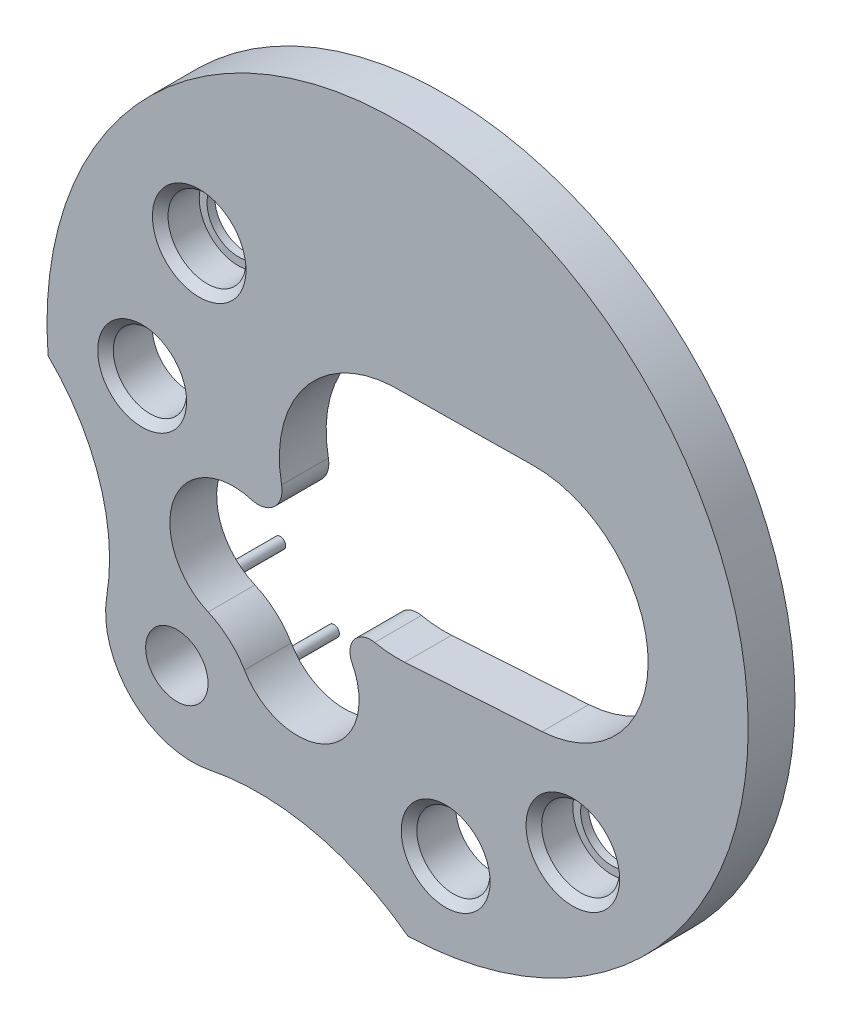
ISO-10303-21;
HEADER;
FILE_DESCRIPTION(('STEP AP214'),'2;1');
FILE_NAME('part.step','',(''),(''),'','','');
FILE_SCHEMA(('AUTOMOTIVE_DESIGN { 1 0 10303 214 1 1 1 1 }'));
ENDSEC;
DATA;
#1=APPLICATION_CONTEXT('core data for automotive mechanical design processes');
#2=APPLICATION_PROTOCOL_DEFINITION('international standard','automotive_design',2000,#1);
#3=PRODUCT_CONTEXT('',#1,'mechanical');
#4=PRODUCT('Part','Part','',(#3));
#5=PRODUCT_RELATED_PRODUCT_CATEGORY('part','',(#4));
#6=PRODUCT_DEFINITION_FORMATION('','',#4);
#7=PRODUCT_DEFINITION_CONTEXT('part definition',#1,'design');
#8=PRODUCT_DEFINITION('design','',#6,#7);
#9=PRODUCT_DEFINITION_SHAPE('','',#8);
#10=(LENGTH_UNIT() NAMED_UNIT(*) SI_UNIT(.MILLI.,.METRE.));
#11=(NAMED_UNIT(*) PLANE_ANGLE_UNIT() SI_UNIT($,.RADIAN.));
#12=(NAMED_UNIT(*) SI_UNIT($,.STERADIAN.) SOLID_ANGLE_UNIT());
#13=UNCERTAINTY_MEASURE_WITH_UNIT(LENGTH_MEASURE(1.E-05),#10,'distance_accuracy_value','');
#14=(GEOMETRIC_REPRESENTATION_CONTEXT(3) GLOBAL_UNCERTAINTY_ASSIGNED_CONTEXT((#13)) GLOBAL_UNIT_ASSIGNED_CONTEXT((#10,
#11,#12)) REPRESENTATION_CONTEXT('',''));
#15=CARTESIAN_POINT('',(0.,0.,0.));
#16=DIRECTION('',(0.,0.,1.));
#17=DIRECTION('',(1.,0.,0.));
#18=AXIS2_PLACEMENT_3D('',#15,#16,#17);
#19=CARTESIAN_POINT('',(38.1336619041062,-13.7694391477594,7.85978802184939));
#20=DIRECTION('',(0.,0.,-1.));
#21=DIRECTION('',(-1.,0.,0.));
#22=AXIS2_PLACEMENT_3D('',#19,#20,#21);
#23=CYLINDRICAL_SURFACE('',#22,0.61);
#24=CARTESIAN_POINT('',(38.1336619041062,-13.7694391477594,7.73778802184196));
#25=DIRECTION('',(0.,0.,1.));
#26=DIRECTION('',(1.,0.,0.));
#27=AXIS2_PLACEMENT_3D('',#24,#25,#26);
#28=CIRCLE('',#27,0.609999999987422);
#29=CARTESIAN_POINT('',(38.7436619040936,-13.7694391477594,7.73778802184196));
#30=VERTEX_POINT('',#29);
#31=EDGE_CURVE('E125',#30,#30,#28,.T.);
#32=ORIENTED_EDGE('',*,*,#31,.T.);
#33=EDGE_LOOP('',(#32));
#34=FACE_BOUND('',#33,.T.);
#35=CARTESIAN_POINT('',(38.1336619041062,-13.7694391477594,7.24978802184939));
#36=DIRECTION('',(0.,0.,-1.));
#37=DIRECTION('',(-1.,0.,0.));
#38=AXIS2_PLACEMENT_3D('',#35,#36,#37);
#39=CIRCLE('',#38,0.61);
#40=CARTESIAN_POINT('',(37.5236619041062,-13.7694391477594,7.24978802184939));
#41=VERTEX_POINT('',#40);
#42=EDGE_CURVE('E39',#41,#41,#39,.F.);
#43=ORIENTED_EDGE('',*,*,#42,.F.);
#44=EDGE_LOOP('',(#43));
#45=FACE_BOUND('',#44,.T.);
#46=ADVANCED_FACE('F36',(#34,#45),#23,.F.);
#47=CARTESIAN_POINT('',(43.9795275046916,-19.0988890111935,7.85978802184939));
#48=DIRECTION('',(0.,0.,-1.));
#49=DIRECTION('',(-1.,0.,0.));
#50=AXIS2_PLACEMENT_3D('',#47,#48,#49);
#51=CYLINDRICAL_SURFACE('',#50,0.61);
#52=CARTESIAN_POINT('',(43.9795275046916,-19.0988890111935,7.73778802185583));
#53=DIRECTION('',(0.,0.,1.));
#54=DIRECTION('',(1.,0.,0.));
#55=AXIS2_PLACEMENT_3D('',#52,#53,#54);
#56=CIRCLE('',#55,0.609999999991318);
#57=CARTESIAN_POINT('',(44.589527504683,-19.0988890111935,7.73778802185583));
#58=VERTEX_POINT('',#57);
#59=EDGE_CURVE('E122',#58,#58,#56,.T.);
#60=ORIENTED_EDGE('',*,*,#59,.T.);
#61=EDGE_LOOP('',(#60));
#62=FACE_BOUND('',#61,.T.);
#63=CARTESIAN_POINT('',(43.9795275046916,-19.0988890111935,7.24978802184939));
#64=DIRECTION('',(0.,0.,-1.));
#65=DIRECTION('',(-1.,0.,0.));
#66=AXIS2_PLACEMENT_3D('',#63,#64,#65);
#67=CIRCLE('',#66,0.61);
#68=CARTESIAN_POINT('',(43.3695275046916,-19.0988890111935,7.24978802184939));
#69=VERTEX_POINT('',#68);
#70=EDGE_CURVE('E236',#69,#69,#67,.F.);
#71=ORIENTED_EDGE('',*,*,#70,.F.);
#72=EDGE_LOOP('',(#71));
#73=FACE_BOUND('',#72,.T.);
#74=ADVANCED_FACE('F246',(#62,#73),#51,.F.);
#75=CARTESIAN_POINT('',(38.1336619041062,-13.7694391477594,7.85978802185294));
#76=DIRECTION('',(0.,0.,1.));
#77=DIRECTION('',(1.,0.,0.));
#78=AXIS2_PLACEMENT_3D('',#75,#76,#77);
#79=CONICAL_SURFACE('',#78,0.731999999984537,0.785398163340605);
#80=CARTESIAN_POINT('',(38.1336619041062,-13.7694391477594,7.85978802185294));
#81=DIRECTION('',(0.,0.,1.));
#82=DIRECTION('',(1.,0.,0.));
#83=AXIS2_PLACEMENT_3D('',#80,#81,#82);
#84=CIRCLE('',#83,0.731999999984537);
#85=CARTESIAN_POINT('',(38.8656619040907,-13.7694391477594,7.85978802185294));
#86=VERTEX_POINT('',#85);
#87=EDGE_CURVE('E234',#86,#86,#84,.F.);
#88=ORIENTED_EDGE('',*,*,#87,.F.);
#89=EDGE_LOOP('',(#88));
#90=FACE_BOUND('',#89,.T.);
#91=ORIENTED_EDGE('',*,*,#31,.F.);
#92=EDGE_LOOP('',(#91));
#93=FACE_BOUND('',#92,.T.);
#94=ADVANCED_FACE('F251',(#90,#93),#79,.F.);
#95=CARTESIAN_POINT('',(43.9795275046916,-19.0988890111935,7.85978802183907));
#96=DIRECTION('',(0.,0.,1.));
#97=DIRECTION('',(1.,0.,0.));
#98=AXIS2_PLACEMENT_3D('',#95,#96,#97);
#99=CONICAL_SURFACE('',#98,0.731999999974564,0.785398163340605);
#100=CARTESIAN_POINT('',(43.9795275046916,-19.0988890111935,7.85978802185294));
#101=DIRECTION('',(0.,0.,1.));
#102=DIRECTION('',(1.,0.,0.));
#103=AXIS2_PLACEMENT_3D('',#100,#101,#102);
#104=CIRCLE('',#103,0.731999999988434);
#105=CARTESIAN_POINT('',(44.7115275046801,-19.0988890111935,7.85978802185294));
#106=VERTEX_POINT('',#105);
#107=EDGE_CURVE('E231',#106,#106,#104,.F.);
#108=ORIENTED_EDGE('',*,*,#107,.F.);
#109=EDGE_LOOP('',(#108));
#110=FACE_BOUND('',#109,.T.);
#111=ORIENTED_EDGE('',*,*,#59,.F.);
#112=EDGE_LOOP('',(#111));
#113=FACE_BOUND('',#112,.T.);
#114=ADVANCED_FACE('F367',(#110,#113),#99,.F.);
#115=CARTESIAN_POINT('',(38.1336619041062,-13.7694391477594,7.24978802184939));
#116=DIRECTION('',(0.,0.,1.));
#117=DIRECTION('',(1.,0.,0.));
#118=AXIS2_PLACEMENT_3D('',#115,#116,#117);
#119=PLANE('',#118);
#120=CARTESIAN_POINT('',(38.1336619041062,-13.7694391477594,7.24978802184939));
#121=DIRECTION('',(0.,0.,1.));
#122=DIRECTION('',(1.,0.,0.));
#123=AXIS2_PLACEMENT_3D('',#120,#121,#122);
#124=CIRCLE('',#123,0.488);
#125=CARTESIAN_POINT('',(38.6216619041062,-13.7694391477594,7.24978802184939));
#126=VERTEX_POINT('',#125);
#127=EDGE_CURVE('E191',#126,#126,#124,.F.);
#128=ORIENTED_EDGE('',*,*,#127,.T.);
#129=EDGE_LOOP('',(#128));
#130=FACE_BOUND('',#129,.T.);
#131=ORIENTED_EDGE('',*,*,#42,.T.);
#132=EDGE_LOOP('',(#131));
#133=FACE_BOUND('',#132,.T.);
#134=ADVANCED_FACE('F243',(#130,#133),#119,.T.);
#135=CARTESIAN_POINT('',(37.2405623710244,-16.0148110692987,7.8597880218252));
#136=DIRECTION('',(0.,0.,1.));
#137=DIRECTION('',(1.,0.,0.));
#138=AXIS2_PLACEMENT_3D('',#135,#136,#137);
#139=CONICAL_SURFACE('',#138,0.695399999973681,0.785398163454292);
#140=CARTESIAN_POINT('',(37.2405623710244,-16.0148110692987,7.73778802184939));
#141=DIRECTION('',(0.,0.,1.));
#142=DIRECTION('',(1.,0.,0.));
#143=AXIS2_PLACEMENT_3D('',#140,#141,#142);
#144=CIRCLE('',#143,0.5734);
#145=CARTESIAN_POINT('',(37.8139623710244,-16.0148110692987,7.73778802184939));
#146=VERTEX_POINT('',#145);
#147=EDGE_CURVE('E190',#146,#146,#144,.F.);
#148=ORIENTED_EDGE('',*,*,#147,.T.);
#149=EDGE_LOOP('',(#148));
#150=FACE_BOUND('',#149,.T.);
#151=CARTESIAN_POINT('',(37.2405623710244,-16.0148110692987,7.8597880218434));
#152=DIRECTION('',(0.,0.,1.));
#153=DIRECTION('',(1.,0.,0.));
#154=AXIS2_PLACEMENT_3D('',#151,#152,#153);
#155=CIRCLE('',#154,0.695399999991878);
#156=CARTESIAN_POINT('',(37.9359623710163,-16.0148110692987,7.8597880218434));
#157=VERTEX_POINT('',#156);
#158=EDGE_CURVE('E99',#157,#157,#155,.F.);
#159=ORIENTED_EDGE('',*,*,#158,.F.);
#160=EDGE_LOOP('',(#159));
#161=FACE_BOUND('',#160,.T.);
#162=ADVANCED_FACE('F360',(#150,#161),#139,.F.);
#163=CARTESIAN_POINT('',(43.9795275046916,-19.0988890111935,7.24978802184939));
#164=DIRECTION('',(0.,0.,1.));
#165=DIRECTION('',(1.,0.,0.));
#166=AXIS2_PLACEMENT_3D('',#163,#164,#165);
#167=PLANE('',#166);
#168=CARTESIAN_POINT('',(43.9795275046916,-19.0988890111935,7.24978802184939));
#169=DIRECTION('',(0.,0.,1.));
#170=DIRECTION('',(1.,0.,0.));
#171=AXIS2_PLACEMENT_3D('',#168,#169,#170);
#172=CIRCLE('',#171,0.488);
#173=CARTESIAN_POINT('',(44.4675275046916,-19.0988890111935,7.24978802184939));
#174=VERTEX_POINT('',#173);
#175=EDGE_CURVE('E187',#174,#174,#172,.F.);
#176=ORIENTED_EDGE('',*,*,#175,.T.);
#177=EDGE_LOOP('',(#176));
#178=FACE_BOUND('',#177,.T.);
#179=ORIENTED_EDGE('',*,*,#70,.T.);
#180=EDGE_LOOP('',(#179));
#181=FACE_BOUND('',#180,.T.);
#182=ADVANCED_FACE('F356',(#178,#181),#167,.T.);
#183=CARTESIAN_POINT('',(41.9893103568643,-20.1477658422483,7.85978802185294));
#184=DIRECTION('',(0.,0.,1.));
#185=DIRECTION('',(1.,0.,0.));
#186=AXIS2_PLACEMENT_3D('',#183,#184,#185);
#187=CONICAL_SURFACE('',#186,0.695400000002009,0.785398163397448);
#188=CARTESIAN_POINT('',(41.9893103568643,-20.1477658422483,7.73778802184939));
#189=DIRECTION('',(0.,0.,1.));
#190=DIRECTION('',(1.,0.,0.));
#191=AXIS2_PLACEMENT_3D('',#188,#189,#190);
#192=CIRCLE('',#191,0.5734);
#193=CARTESIAN_POINT('',(42.5627103568643,-20.1477658422483,7.73778802184939));
#194=VERTEX_POINT('',#193);
#195=EDGE_CURVE('E186',#194,#194,#192,.F.);
#196=ORIENTED_EDGE('',*,*,#195,.T.);
#197=EDGE_LOOP('',(#196));
#198=FACE_BOUND('',#197,.T.);
#199=CARTESIAN_POINT('',(41.9893103568643,-20.1477658422483,7.85978802185294));
#200=DIRECTION('',(0.,0.,1.));
#201=DIRECTION('',(1.,0.,0.));
#202=AXIS2_PLACEMENT_3D('',#199,#200,#201);
#203=CIRCLE('',#202,0.695400000002009);
#204=CARTESIAN_POINT('',(42.6847103568663,-20.1477658422483,7.85978802185294));
#205=VERTEX_POINT('',#204);
#206=EDGE_CURVE('E228',#205,#205,#203,.F.);
#207=ORIENTED_EDGE('',*,*,#206,.F.);
#208=EDGE_LOOP('',(#207));
#209=FACE_BOUND('',#208,.T.);
#210=ADVANCED_FACE('F352',(#198,#209),#187,.F.);
#211=CARTESIAN_POINT('',(41.0582115328778,-16.1168968136741,7.85978802184939));
#212=DIRECTION('',(0.,0.,1.));
#213=DIRECTION('',(1.,0.,0.));
#214=AXIS2_PLACEMENT_3D('',#211,#212,#213);
#215=PLANE('',#214);
#216=ORIENTED_EDGE('',*,*,#158,.T.);
#217=EDGE_LOOP('',(#216));
#218=FACE_BOUND('',#217,.T.);
#219=ORIENTED_EDGE('',*,*,#206,.T.);
#220=EDGE_LOOP('',(#219));
#221=FACE_BOUND('',#220,.T.);
#222=CARTESIAN_POINT('',(37.7835013486702,-19.6676256288766,7.85978802184939));
#223=DIRECTION('',(0.,0.,1.));
#224=DIRECTION('',(1.,0.,0.));
#225=AXIS2_PLACEMENT_3D('',#222,#223,#224);
#226=CIRCLE('',#225,0.488);
#227=CARTESIAN_POINT('',(38.2715013486702,-19.6676256288766,7.85978802184939));
#228=VERTEX_POINT('',#227);
#229=EDGE_CURVE('E183',#228,#228,#226,.F.);
#230=ORIENTED_EDGE('',*,*,#229,.T.);
#231=EDGE_LOOP('',(#230));
#232=FACE_BOUND('',#231,.T.);
#233=CARTESIAN_POINT('',(38.6659590422914,-17.7867727829153,7.85978802184939));
#234=DIRECTION('',(0.,0.,1.));
#235=DIRECTION('',(1.,0.,0.));
#236=AXIS2_PLACEMENT_3D('',#233,#234,#235);
#237=CIRCLE('',#236,0.991674632911348);
#238=CARTESIAN_POINT('',(38.2730184708911,-18.6972760969714,7.85978802184939));
#239=VERTEX_POINT('',#238);
#240=CARTESIAN_POINT('',(38.9459024987134,-16.83543149885,7.85978802184939));
#241=VERTEX_POINT('',#240);
#242=EDGE_CURVE('E198',#239,#241,#237,.F.);
#243=ORIENTED_EDGE('',*,*,#242,.T.);
#244=CARTESIAN_POINT('',(39.052299831871,-16.4738578552267,7.85978802184939));
#245=DIRECTION('',(0.,0.,1.));
#246=DIRECTION('',(1.,0.,0.));
#247=AXIS2_PLACEMENT_3D('',#244,#245,#246);
#248=CIRCLE('',#247,0.376903027668744);
#249=CARTESIAN_POINT('',(39.4221081989458,-16.4010728024538,7.85978802184939));
#250=VERTEX_POINT('',#249);
#251=EDGE_CURVE('E194',#250,#241,#248,.F.);
#252=ORIENTED_EDGE('',*,*,#251,.F.);
#253=CARTESIAN_POINT('',(41.2374827506637,-16.0437738760014,7.85978802184939));
#254=DIRECTION('',(0.,0.,1.));
#255=DIRECTION('',(1.,0.,0.));
#256=AXIS2_PLACEMENT_3D('',#253,#254,#255);
#257=CIRCLE('',#256,1.85020195813052);
#258=CARTESIAN_POINT('',(41.1506610272166,-14.19561011859,7.85978802184939));
#259=VERTEX_POINT('',#258);
#260=EDGE_CURVE('E88',#250,#259,#257,.F.);
#261=ORIENTED_EDGE('',*,*,#260,.T.);
#262=DIRECTION('',(0.999922672411607,0.0124358030391901,0.));
#263=VECTOR('',#262,1.);
#264=CARTESIAN_POINT('',(42.2578860435572,-14.1818398215429,7.85978802184939));
#265=LINE('',#264,#263);
#266=CARTESIAN_POINT('',(43.3651110599051,-14.1680695244953,7.85978802184939));
#267=VERTEX_POINT('',#266);
#268=EDGE_CURVE('E117',#267,#259,#265,.F.);
#269=ORIENTED_EDGE('',*,*,#268,.F.);
#270=CARTESIAN_POINT('',(43.3871299694428,-15.9385387735962,7.85978802184939));
#271=DIRECTION('',(0.,0.,1.));
#272=DIRECTION('',(1.,0.,0.));
#273=AXIS2_PLACEMENT_3D('',#270,#271,#272);
#274=CIRCLE('',#273,1.77060616580602);
#275=CARTESIAN_POINT('',(43.4975725541586,-17.7056971224357,7.85978802184939));
#276=VERTEX_POINT('',#275);
#277=EDGE_CURVE('E120',#267,#276,#274,.F.);
#278=ORIENTED_EDGE('',*,*,#277,.T.);
#279=DIRECTION('',(-0.998052747678446,-0.0623755789672829,0.));
#280=VECTOR('',#279,1.);
#281=CARTESIAN_POINT('',(42.423655115559,-17.7728140380011,7.85978802184939));
#282=LINE('',#281,#280);
#283=CARTESIAN_POINT('',(41.3497376769588,-17.8399309535669,7.85978802184939));
#284=VERTEX_POINT('',#283);
#285=EDGE_CURVE('E112',#284,#276,#282,.F.);
#286=ORIENTED_EDGE('',*,*,#285,.F.);
#287=CARTESIAN_POINT('',(41.2374827506637,-16.0437738760014,7.85978802184939));
#288=DIRECTION('',(0.,0.,1.));
#289=DIRECTION('',(1.,0.,0.));
#290=AXIS2_PLACEMENT_3D('',#287,#288,#289);
#291=CIRCLE('',#290,1.79966147254636);
#292=CARTESIAN_POINT('',(40.8787065760678,-17.8073104002343,7.85978802184939));
#293=VERTEX_POINT('',#292);
#294=EDGE_CURVE('E115',#284,#293,#291,.F.);
#295=ORIENTED_EDGE('',*,*,#294,.T.);
#296=CARTESIAN_POINT('',(40.8144764628586,-18.1230285516044,7.85978802184939));
#297=DIRECTION('',(0.,0.,1.));
#298=DIRECTION('',(1.,0.,0.));
#299=AXIS2_PLACEMENT_3D('',#296,#297,#298);
#300=CIRCLE('',#299,0.322185441240608);
#301=CARTESIAN_POINT('',(40.5280472286448,-18.2705472024132,7.85978802184939));
#302=VERTEX_POINT('',#301);
#303=EDGE_CURVE('E211',#302,#293,#300,.F.);
#304=ORIENTED_EDGE('',*,*,#303,.F.);
#305=CARTESIAN_POINT('',(39.671847283105,-18.7115128780541,7.85978802184939));
#306=DIRECTION('',(0.,0.,1.));
#307=DIRECTION('',(1.,0.,0.));
#308=AXIS2_PLACEMENT_3D('',#305,#306,#307);
#309=CIRCLE('',#308,0.963083108478048);
#310=CARTESIAN_POINT('',(38.8414829225075,-19.1993900167734,7.85978802184939));
#311=VERTEX_POINT('',#310);
#312=EDGE_CURVE('E207',#302,#311,#309,.F.);
#313=ORIENTED_EDGE('',*,*,#312,.T.);
#314=CARTESIAN_POINT('',(37.7896063907618,-19.8174157136195,7.85978802184939));
#315=DIRECTION('',(0.,0.,1.));
#316=DIRECTION('',(1.,0.,0.));
#317=AXIS2_PLACEMENT_3D('',#314,#315,#316);
#318=CIRCLE('',#317,1.22);
#319=EDGE_CURVE('E203',#239,#311,#318,.F.);
#320=ORIENTED_EDGE('',*,*,#319,.F.);
#321=EDGE_LOOP('',(#243,#252,#261,#269,#278,#286,#295,#304,#313,#320));
#322=FACE_BOUND('',#321,.T.);
#323=ORIENTED_EDGE('',*,*,#107,.T.);
#324=EDGE_LOOP('',(#323));
#325=FACE_BOUND('',#324,.T.);
#326=ORIENTED_EDGE('',*,*,#87,.T.);
#327=EDGE_LOOP('',(#326));
#328=FACE_BOUND('',#327,.T.);
#329=CARTESIAN_POINT('',(39.06505027507,-24.64660251159,7.85978802184939));
#330=DIRECTION('',(0.,0.,1.));
#331=DIRECTION('',(1.,0.,0.));
#332=AXIS2_PLACEMENT_3D('',#329,#330,#331);
#333=CIRCLE('',#332,3.89663081484112);
#334=CARTESIAN_POINT('',(38.2918493374231,-20.8274544367975,7.85978802184939));
#335=VERTEX_POINT('',#334);
#336=CARTESIAN_POINT('',(41.4005130726079,-21.527412676316,7.85978802184939));
#337=VERTEX_POINT('',#336);
#338=EDGE_CURVE('E83',#335,#337,#333,.F.);
#339=ORIENTED_EDGE('',*,*,#338,.T.);
#340=CARTESIAN_POINT('',(41.2374827506637,-16.0437738760014,7.85978802184939));
#341=DIRECTION('',(0.,0.,1.));
#342=DIRECTION('',(1.,0.,0.));
#343=AXIS2_PLACEMENT_3D('',#340,#341,#342);
#344=CIRCLE('',#343,5.48606173663672);
#345=CARTESIAN_POINT('',(35.7685979765421,-16.4775626559047,7.85978802184939));
#346=VERTEX_POINT('',#345);
#347=EDGE_CURVE('E77',#346,#337,#344,.F.);
#348=ORIENTED_EDGE('',*,*,#347,.F.);
#349=CARTESIAN_POINT('',(33.5630026451588,-18.7517119612679,7.85978802184939));
#350=DIRECTION('',(0.,0.,1.));
#351=DIRECTION('',(1.,0.,0.));
#352=AXIS2_PLACEMENT_3D('',#349,#350,#351);
#353=CIRCLE('',#352,3.1680286976142);
#354=CARTESIAN_POINT('',(36.6873657132964,-19.2758886942166,7.85978802184939));
#355=VERTEX_POINT('',#354);
#356=EDGE_CURVE('E81',#346,#355,#353,.F.);
#357=ORIENTED_EDGE('',*,*,#356,.T.);
#358=CARTESIAN_POINT('',(38.0230982512306,-19.4999855429369,7.85978802184939));
#359=DIRECTION('',(0.,0.,1.));
#360=DIRECTION('',(1.,0.,0.));
#361=AXIS2_PLACEMENT_3D('',#358,#359,#360);
#362=CIRCLE('',#361,1.35440053547773);
#363=EDGE_CURVE('E223',#335,#355,#362,.F.);
#364=ORIENTED_EDGE('',*,*,#363,.F.);
#365=EDGE_LOOP('',(#339,#348,#357,#364));
#366=FACE_BOUND('',#365,.T.);
#367=ADVANCED_FACE('F79',(#218,#221,#232,#322,#325,#328,#366),#215,.T.);
#368=CARTESIAN_POINT('',(42.2578860435572,-14.1818398215429,6.39578802184939));
#369=DIRECTION('',(0.,0.,-1.));
#370=DIRECTION('',(-1.,0.,0.));
#371=AXIS2_PLACEMENT_3D('',#368,#369,#370);
#372=PLANE('',#371);
#373=CARTESIAN_POINT('',(38.7769454737327,-19.4314145580513,6.39578802184939));
#374=DIRECTION('',(0.,0.,-1.));
#375=DIRECTION('',(-1.,0.,0.));
#376=AXIS2_PLACEMENT_3D('',#373,#374,#375);
#377=CIRCLE('',#376,0.0854);
#378=CARTESIAN_POINT('',(38.6915454737327,-19.4314145580513,6.39578802184939));
#379=VERTEX_POINT('',#378);
#380=EDGE_CURVE('E180',#379,#379,#377,.F.);
#381=ORIENTED_EDGE('',*,*,#380,.F.);
#382=EDGE_LOOP('',(#381));
#383=FACE_BOUND('',#382,.T.);
#384=ADVANCED_FACE('F345',(#383),#372,.T.);
#385=CARTESIAN_POINT('',(42.2578860435572,-14.1818398215429,6.39578802184939));
#386=DIRECTION('',(0.,0.,-1.));
#387=DIRECTION('',(-1.,0.,0.));
#388=AXIS2_PLACEMENT_3D('',#385,#386,#387);
#389=PLANE('',#388);
#390=CARTESIAN_POINT('',(37.936640976968,-18.6580340511375,6.39578802184939));
#391=DIRECTION('',(0.,0.,-1.));
#392=DIRECTION('',(-1.,0.,0.));
#393=AXIS2_PLACEMENT_3D('',#390,#391,#392);
#394=CIRCLE('',#393,0.0854);
#395=CARTESIAN_POINT('',(37.851240976968,-18.6580340511375,6.39578802184939));
#396=VERTEX_POINT('',#395);
#397=EDGE_CURVE('E177',#396,#396,#394,.F.);
#398=ORIENTED_EDGE('',*,*,#397,.F.);
#399=EDGE_LOOP('',(#398));
#400=FACE_BOUND('',#399,.T.);
#401=ADVANCED_FACE('F342',(#400),#389,.T.);
#402=CARTESIAN_POINT('',(33.5630026451588,-18.7517119612679,7.12778802184939));
#403=DIRECTION('',(0.,0.,1.));
#404=DIRECTION('',(1.,0.,0.));
#405=AXIS2_PLACEMENT_3D('',#402,#403,#404);
#406=CYLINDRICAL_SURFACE('',#405,3.1680286976142);
#407=CARTESIAN_POINT('',(33.5630026451588,-18.7517119612679,7.12778802184939));
#408=DIRECTION('',(0.,0.,1.));
#409=DIRECTION('',(1.,0.,0.));
#410=AXIS2_PLACEMENT_3D('',#407,#408,#409);
#411=CIRCLE('',#410,3.1680286976142);
#412=CARTESIAN_POINT('',(35.7685979765421,-16.4775626559047,7.12778802184939));
#413=VERTEX_POINT('',#412);
#414=CARTESIAN_POINT('',(36.6873657132964,-19.2758886942166,7.12778802184939));
#415=VERTEX_POINT('',#414);
#416=EDGE_CURVE('E174',#413,#415,#411,.F.);
#417=ORIENTED_EDGE('',*,*,#416,.T.);
#418=DIRECTION('',(0.,0.,1.));
#419=VECTOR('',#418,1.);
#420=CARTESIAN_POINT('',(36.6873657132964,-19.2758886942167,7.12778802184939));
#421=LINE('',#420,#419);
#422=EDGE_CURVE('E98',#355,#415,#421,.F.);
#423=ORIENTED_EDGE('',*,*,#422,.F.);
#424=ORIENTED_EDGE('',*,*,#356,.F.);
#425=DIRECTION('',(0.,0.,1.));
#426=VECTOR('',#425,1.);
#427=CARTESIAN_POINT('',(35.7685979765421,-16.4775626559055,7.12778802184939));
#428=LINE('',#427,#426);
#429=EDGE_CURVE('E89',#413,#346,#428,.T.);
#430=ORIENTED_EDGE('',*,*,#429,.F.);
#431=EDGE_LOOP('',(#417,#423,#424,#430));
#432=FACE_BOUND('',#431,.T.);
#433=ADVANCED_FACE('F94',(#432),#406,.F.);
#434=CARTESIAN_POINT('',(38.0230982512306,-19.4999855429369,7.12778802184939));
#435=DIRECTION('',(0.,0.,1.));
#436=DIRECTION('',(1.,0.,0.));
#437=AXIS2_PLACEMENT_3D('',#434,#435,#436);
#438=CYLINDRICAL_SURFACE('',#437,1.35440053547773);
#439=DIRECTION('',(0.,0.,1.));
#440=VECTOR('',#439,1.);
#441=CARTESIAN_POINT('',(38.2918493374232,-20.8274544367975,7.12778802184939));
#442=LINE('',#441,#440);
#443=CARTESIAN_POINT('',(38.2918493374231,-20.8274544367975,7.12778802184939));
#444=VERTEX_POINT('',#443);
#445=EDGE_CURVE('E107',#444,#335,#442,.T.);
#446=ORIENTED_EDGE('',*,*,#445,.T.);
#447=ORIENTED_EDGE('',*,*,#363,.T.);
#448=ORIENTED_EDGE('',*,*,#422,.T.);
#449=CARTESIAN_POINT('',(38.0230982512306,-19.4999855429369,7.12778802184939));
#450=DIRECTION('',(0.,0.,1.));
#451=DIRECTION('',(1.,0.,0.));
#452=AXIS2_PLACEMENT_3D('',#449,#450,#451);
#453=CIRCLE('',#452,1.35440053547773);
#454=EDGE_CURVE('E171',#415,#444,#453,.T.);
#455=ORIENTED_EDGE('',*,*,#454,.T.);
#456=EDGE_LOOP('',(#446,#447,#448,#455));
#457=FACE_BOUND('',#456,.T.);
#458=ADVANCED_FACE('F335',(#457),#438,.T.);
#459=CARTESIAN_POINT('',(39.06505027507,-24.64660251159,7.12778802184939));
#460=DIRECTION('',(0.,0.,1.));
#461=DIRECTION('',(1.,0.,0.));
#462=AXIS2_PLACEMENT_3D('',#459,#460,#461);
#463=CYLINDRICAL_SURFACE('',#462,3.89663081484112);
#464=CARTESIAN_POINT('',(39.06505027507,-24.64660251159,7.12778802184939));
#465=DIRECTION('',(0.,0.,1.));
#466=DIRECTION('',(1.,0.,0.));
#467=AXIS2_PLACEMENT_3D('',#464,#465,#466);
#468=CIRCLE('',#467,3.89663081484112);
#469=CARTESIAN_POINT('',(41.4005130726079,-21.527412676316,7.12778802184939));
#470=VERTEX_POINT('',#469);
#471=EDGE_CURVE('E168',#444,#470,#468,.F.);
#472=ORIENTED_EDGE('',*,*,#471,.T.);
#473=DIRECTION('',(0.,0.,1.));
#474=VECTOR('',#473,1.);
#475=CARTESIAN_POINT('',(41.4005130726059,-21.5274126763161,7.12778802184939));
#476=LINE('',#475,#474);
#477=EDGE_CURVE('E105',#337,#470,#476,.F.);
#478=ORIENTED_EDGE('',*,*,#477,.F.);
#479=ORIENTED_EDGE('',*,*,#338,.F.);
#480=ORIENTED_EDGE('',*,*,#445,.F.);
#481=EDGE_LOOP('',(#472,#478,#479,#480));
#482=FACE_BOUND('',#481,.T.);
#483=ADVANCED_FACE('F332',(#482),#463,.F.);
#484=CARTESIAN_POINT('',(41.2374827506637,-16.0437738760014,7.12778802184939));
#485=DIRECTION('',(0.,0.,1.));
#486=DIRECTION('',(1.,0.,0.));
#487=AXIS2_PLACEMENT_3D('',#484,#485,#486);
#488=CYLINDRICAL_SURFACE('',#487,5.48606173663672);
#489=ORIENTED_EDGE('',*,*,#429,.T.);
#490=ORIENTED_EDGE('',*,*,#347,.T.);
#491=ORIENTED_EDGE('',*,*,#477,.T.);
#492=CARTESIAN_POINT('',(41.2374827506637,-16.0437738760014,7.12778802184939));
#493=DIRECTION('',(0.,0.,1.));
#494=DIRECTION('',(1.,0.,0.));
#495=AXIS2_PLACEMENT_3D('',#492,#493,#494);
#496=CIRCLE('',#495,5.48606173663672);
#497=EDGE_CURVE('E104',#470,#413,#496,.T.);
#498=ORIENTED_EDGE('',*,*,#497,.T.);
#499=EDGE_LOOP('',(#489,#490,#491,#498));
#500=FACE_BOUND('',#499,.T.);
#501=ADVANCED_FACE('F102',(#500),#488,.T.);
#502=CARTESIAN_POINT('',(41.2374827506637,-16.0437738760014,7.12778802184939));
#503=DIRECTION('',(0.,0.,1.));
#504=DIRECTION('',(1.,0.,0.));
#505=AXIS2_PLACEMENT_3D('',#502,#503,#504);
#506=CYLINDRICAL_SURFACE('',#505,1.85020195813052);
#507=DIRECTION('',(0.,0.,1.));
#508=VECTOR('',#507,1.);
#509=CARTESIAN_POINT('',(39.4221081989461,-16.4010728024537,7.12778802184939));
#510=LINE('',#509,#508);
#511=CARTESIAN_POINT('',(39.4221081989458,-16.4010728024538,7.12778802184939));
#512=VERTEX_POINT('',#511);
#513=EDGE_CURVE('E197',#512,#250,#510,.T.);
#514=ORIENTED_EDGE('',*,*,#513,.F.);
#515=CARTESIAN_POINT('',(41.2374827506637,-16.0437738760014,7.12778802184939));
#516=DIRECTION('',(0.,0.,1.));
#517=DIRECTION('',(1.,0.,0.));
#518=AXIS2_PLACEMENT_3D('',#515,#516,#517);
#519=CIRCLE('',#518,1.85020195813052);
#520=CARTESIAN_POINT('',(41.1506610272177,-14.1956101185899,7.12778802184939));
#521=VERTEX_POINT('',#520);
#522=EDGE_CURVE('E54',#512,#521,#519,.F.);
#523=ORIENTED_EDGE('',*,*,#522,.T.);
#524=DIRECTION('',(0.,0.,1.));
#525=VECTOR('',#524,1.);
#526=CARTESIAN_POINT('',(41.1506610272066,-14.1956101185901,7.12778802184939));
#527=LINE('',#526,#525);
#528=EDGE_CURVE('E121',#259,#521,#527,.F.);
#529=ORIENTED_EDGE('',*,*,#528,.F.);
#530=ORIENTED_EDGE('',*,*,#260,.F.);
#531=EDGE_LOOP('',(#514,#523,#529,#530));
#532=FACE_BOUND('',#531,.T.);
#533=ADVANCED_FACE('F325',(#532),#506,.F.);
#534=CARTESIAN_POINT('',(42.2578860435572,-14.1818398215429,7.12778802184939));
#535=DIRECTION('',(0.0124358030391901,-0.999922672411607,0.));
#536=DIRECTION('',(0.999922672411607,0.0124358030391901,0.));
#537=AXIS2_PLACEMENT_3D('',#534,#535,#536);
#538=PLANE('',#537);
#539=DIRECTION('',(0.,0.,1.));
#540=VECTOR('',#539,1.);
#541=CARTESIAN_POINT('',(43.3651110599054,-14.1680695244949,7.12778802184939));
#542=LINE('',#541,#540);
#543=CARTESIAN_POINT('',(43.3651110599052,-14.1680695244953,7.12778802184939));
#544=VERTEX_POINT('',#543);
#545=EDGE_CURVE('E220',#544,#267,#542,.T.);
#546=ORIENTED_EDGE('',*,*,#545,.T.);
#547=ORIENTED_EDGE('',*,*,#268,.T.);
#548=ORIENTED_EDGE('',*,*,#528,.T.);
#549=DIRECTION('',(0.999922672411608,0.0124358030391327,0.));
#550=VECTOR('',#549,1.);
#551=CARTESIAN_POINT('',(41.1506610272066,-14.19561011859,7.12778802184939));
#552=LINE('',#551,#550);
#553=EDGE_CURVE('E166',#521,#544,#552,.T.);
#554=ORIENTED_EDGE('',*,*,#553,.T.);
#555=EDGE_LOOP('',(#546,#547,#548,#554));
#556=FACE_BOUND('',#555,.T.);
#557=ADVANCED_FACE('F321',(#556),#538,.T.);
#558=CARTESIAN_POINT('',(43.3871299694428,-15.9385387735962,7.12778802184939));
#559=DIRECTION('',(0.,0.,1.));
#560=DIRECTION('',(1.,0.,0.));
#561=AXIS2_PLACEMENT_3D('',#558,#559,#560);
#562=CYLINDRICAL_SURFACE('',#561,1.77060616580602);
#563=CARTESIAN_POINT('',(43.3871299694428,-15.9385387735962,7.12778802184939));
#564=DIRECTION('',(0.,0.,1.));
#565=DIRECTION('',(1.,0.,0.));
#566=AXIS2_PLACEMENT_3D('',#563,#564,#565);
#567=CIRCLE('',#566,1.77060616580602);
#568=CARTESIAN_POINT('',(43.4975725541591,-17.7056971224354,7.12778802184939));
#569=VERTEX_POINT('',#568);
#570=EDGE_CURVE('E163',#544,#569,#567,.F.);
#571=ORIENTED_EDGE('',*,*,#570,.T.);
#572=DIRECTION('',(0.,0.,1.));
#573=VECTOR('',#572,1.);
#574=CARTESIAN_POINT('',(43.4975725541593,-17.7056971224357,7.12778802184939));
#575=LINE('',#574,#573);
#576=EDGE_CURVE('E116',#276,#569,#575,.F.);
#577=ORIENTED_EDGE('',*,*,#576,.F.);
#578=ORIENTED_EDGE('',*,*,#277,.F.);
#579=ORIENTED_EDGE('',*,*,#545,.F.);
#580=EDGE_LOOP('',(#571,#577,#578,#579));
#581=FACE_BOUND('',#580,.T.);
#582=ADVANCED_FACE('F317',(#581),#562,.F.);
#583=CARTESIAN_POINT('',(42.423655115559,-17.7728140380011,7.12778802184939));
#584=DIRECTION('',(-0.0623755789672829,0.998052747678446,0.));
#585=DIRECTION('',(-0.998052747678446,-0.0623755789672829,0.));
#586=AXIS2_PLACEMENT_3D('',#583,#584,#585);
#587=PLANE('',#586);
#588=DIRECTION('',(0.,0.,1.));
#589=VECTOR('',#588,1.);
#590=CARTESIAN_POINT('',(41.3497376769587,-17.8399309535673,7.12778802184939));
#591=LINE('',#590,#589);
#592=CARTESIAN_POINT('',(41.3497376769593,-17.8399309535672,7.12778802184939));
#593=VERTEX_POINT('',#592);
#594=EDGE_CURVE('E217',#593,#284,#591,.T.);
#595=ORIENTED_EDGE('',*,*,#594,.T.);
#596=ORIENTED_EDGE('',*,*,#285,.T.);
#597=ORIENTED_EDGE('',*,*,#576,.T.);
#598=DIRECTION('',(-0.998052747678414,-0.0623755789677978,0.));
#599=VECTOR('',#598,1.);
#600=CARTESIAN_POINT('',(43.4975725541592,-17.7056971224351,7.12778802184939));
#601=LINE('',#600,#599);
#602=EDGE_CURVE('E162',#569,#593,#601,.T.);
#603=ORIENTED_EDGE('',*,*,#602,.T.);
#604=EDGE_LOOP('',(#595,#596,#597,#603));
#605=FACE_BOUND('',#604,.T.);
#606=ADVANCED_FACE('F313',(#605),#587,.T.);
#607=CARTESIAN_POINT('',(41.2374827506637,-16.0437738760014,7.12778802184939));
#608=DIRECTION('',(0.,0.,1.));
#609=DIRECTION('',(1.,0.,0.));
#610=AXIS2_PLACEMENT_3D('',#607,#608,#609);
#611=CYLINDRICAL_SURFACE('',#610,1.79966147254636);
#612=CARTESIAN_POINT('',(41.2374827506637,-16.0437738760014,7.12778802184939));
#613=DIRECTION('',(0.,0.,1.));
#614=DIRECTION('',(1.,0.,0.));
#615=AXIS2_PLACEMENT_3D('',#612,#613,#614);
#616=CIRCLE('',#615,1.79966147254636);
#617=CARTESIAN_POINT('',(40.8787065760678,-17.8073104002343,7.12778802184939));
#618=VERTEX_POINT('',#617);
#619=EDGE_CURVE('E159',#593,#618,#616,.F.);
#620=ORIENTED_EDGE('',*,*,#619,.T.);
#621=DIRECTION('',(0.,0.,1.));
#622=VECTOR('',#621,1.);
#623=CARTESIAN_POINT('',(40.8787065760681,-17.8073104002344,7.12778802184939));
#624=LINE('',#623,#622);
#625=EDGE_CURVE('E214',#293,#618,#624,.F.);
#626=ORIENTED_EDGE('',*,*,#625,.F.);
#627=ORIENTED_EDGE('',*,*,#294,.F.);
#628=ORIENTED_EDGE('',*,*,#594,.F.);
#629=EDGE_LOOP('',(#620,#626,#627,#628));
#630=FACE_BOUND('',#629,.T.);
#631=ADVANCED_FACE('F309',(#630),#611,.F.);
#632=CARTESIAN_POINT('',(40.8144764628586,-18.1230285516044,7.12778802184939));
#633=DIRECTION('',(0.,0.,1.));
#634=DIRECTION('',(1.,0.,0.));
#635=AXIS2_PLACEMENT_3D('',#632,#633,#634);
#636=CYLINDRICAL_SURFACE('',#635,0.322185441240608);
#637=DIRECTION('',(0.,0.,1.));
#638=VECTOR('',#637,1.);
#639=CARTESIAN_POINT('',(40.5280472286448,-18.2705472024132,7.12778802184939));
#640=LINE('',#639,#638);
#641=CARTESIAN_POINT('',(40.5280472286457,-18.2705472024127,7.12778802184939));
#642=VERTEX_POINT('',#641);
#643=EDGE_CURVE('E210',#642,#302,#640,.T.);
#644=ORIENTED_EDGE('',*,*,#643,.T.);
#645=ORIENTED_EDGE('',*,*,#303,.T.);
#646=ORIENTED_EDGE('',*,*,#625,.T.);
#647=CARTESIAN_POINT('',(40.8144764628586,-18.1230285516044,7.12778802184939));
#648=DIRECTION('',(0.,0.,1.));
#649=DIRECTION('',(1.,0.,0.));
#650=AXIS2_PLACEMENT_3D('',#647,#648,#649);
#651=CIRCLE('',#650,0.322185441240608);
#652=EDGE_CURVE('E156',#618,#642,#651,.T.);
#653=ORIENTED_EDGE('',*,*,#652,.T.);
#654=EDGE_LOOP('',(#644,#645,#646,#653));
#655=FACE_BOUND('',#654,.T.);
#656=ADVANCED_FACE('F305',(#655),#636,.T.);
#657=CARTESIAN_POINT('',(39.671847283105,-18.7115128780541,7.12778802184939));
#658=DIRECTION('',(0.,0.,1.));
#659=DIRECTION('',(1.,0.,0.));
#660=AXIS2_PLACEMENT_3D('',#657,#658,#659);
#661=CYLINDRICAL_SURFACE('',#660,0.963083108478048);
#662=CARTESIAN_POINT('',(39.671847283105,-18.7115128780541,7.12778802184939));
#663=DIRECTION('',(0.,0.,1.));
#664=DIRECTION('',(1.,0.,0.));
#665=AXIS2_PLACEMENT_3D('',#662,#663,#664);
#666=CIRCLE('',#665,0.963083108478048);
#667=CARTESIAN_POINT('',(38.8414829225077,-19.1993900167733,7.12778802184939));
#668=VERTEX_POINT('',#667);
#669=EDGE_CURVE('E153',#642,#668,#666,.F.);
#670=ORIENTED_EDGE('',*,*,#669,.T.);
#671=DIRECTION('',(0.,0.,1.));
#672=VECTOR('',#671,1.);
#673=CARTESIAN_POINT('',(38.8414829225076,-19.1993900167731,7.12778802184939));
#674=LINE('',#673,#672);
#675=EDGE_CURVE('E206',#311,#668,#674,.F.);
#676=ORIENTED_EDGE('',*,*,#675,.F.);
#677=ORIENTED_EDGE('',*,*,#312,.F.);
#678=ORIENTED_EDGE('',*,*,#643,.F.);
#679=EDGE_LOOP('',(#670,#676,#677,#678));
#680=FACE_BOUND('',#679,.T.);
#681=ADVANCED_FACE('F301',(#680),#661,.F.);
#682=CARTESIAN_POINT('',(37.7896063907618,-19.8174157136195,7.12778802184939));
#683=DIRECTION('',(0.,0.,1.));
#684=DIRECTION('',(1.,0.,0.));
#685=AXIS2_PLACEMENT_3D('',#682,#683,#684);
#686=CYLINDRICAL_SURFACE('',#685,1.22);
#687=DIRECTION('',(0.,0.,1.));
#688=VECTOR('',#687,1.);
#689=CARTESIAN_POINT('',(38.2730184708904,-18.6972760969714,7.12778802184939));
#690=LINE('',#689,#688);
#691=CARTESIAN_POINT('',(38.273018470891,-18.6972760969716,7.12778802184939));
#692=VERTEX_POINT('',#691);
#693=EDGE_CURVE('E202',#692,#239,#690,.T.);
#694=ORIENTED_EDGE('',*,*,#693,.T.);
#695=ORIENTED_EDGE('',*,*,#319,.T.);
#696=ORIENTED_EDGE('',*,*,#675,.T.);
#697=CARTESIAN_POINT('',(37.7896063907618,-19.8174157136195,7.12778802184939));
#698=DIRECTION('',(0.,0.,1.));
#699=DIRECTION('',(1.,0.,0.));
#700=AXIS2_PLACEMENT_3D('',#697,#698,#699);
#701=CIRCLE('',#700,1.22);
#702=EDGE_CURVE('E150',#668,#692,#701,.T.);
#703=ORIENTED_EDGE('',*,*,#702,.T.);
#704=EDGE_LOOP('',(#694,#695,#696,#703));
#705=FACE_BOUND('',#704,.T.);
#706=ADVANCED_FACE('F297',(#705),#686,.T.);
#707=CARTESIAN_POINT('',(38.6659590422914,-17.7867727829153,7.12778802184939));
#708=DIRECTION('',(0.,0.,1.));
#709=DIRECTION('',(1.,0.,0.));
#710=AXIS2_PLACEMENT_3D('',#707,#708,#709);
#711=CYLINDRICAL_SURFACE('',#710,0.991674632911348);
#712=ORIENTED_EDGE('',*,*,#693,.F.);
#713=CARTESIAN_POINT('',(38.6659590422914,-17.7867727829153,7.12778802184939));
#714=DIRECTION('',(0.,0.,1.));
#715=DIRECTION('',(1.,0.,0.));
#716=AXIS2_PLACEMENT_3D('',#713,#714,#715);
#717=CIRCLE('',#716,0.991674632911348);
#718=CARTESIAN_POINT('',(38.9459024987135,-16.8354314988497,7.12778802184939));
#719=VERTEX_POINT('',#718);
#720=EDGE_CURVE('E148',#692,#719,#717,.F.);
#721=ORIENTED_EDGE('',*,*,#720,.T.);
#722=DIRECTION('',(0.,0.,1.));
#723=VECTOR('',#722,1.);
#724=CARTESIAN_POINT('',(38.9459024987134,-16.8354314988496,7.12778802184939));
#725=LINE('',#724,#723);
#726=EDGE_CURVE('E201',#241,#719,#725,.F.);
#727=ORIENTED_EDGE('',*,*,#726,.F.);
#728=ORIENTED_EDGE('',*,*,#242,.F.);
#729=EDGE_LOOP('',(#712,#721,#727,#728));
#730=FACE_BOUND('',#729,.T.);
#731=ADVANCED_FACE('F293',(#730),#711,.F.);
#732=CARTESIAN_POINT('',(39.052299831871,-16.4738578552267,7.12778802184939));
#733=DIRECTION('',(0.,0.,1.));
#734=DIRECTION('',(1.,0.,0.));
#735=AXIS2_PLACEMENT_3D('',#732,#733,#734);
#736=CYLINDRICAL_SURFACE('',#735,0.376903027668744);
#737=ORIENTED_EDGE('',*,*,#513,.T.);
#738=ORIENTED_EDGE('',*,*,#251,.T.);
#739=ORIENTED_EDGE('',*,*,#726,.T.);
#740=CARTESIAN_POINT('',(39.052299831871,-16.4738578552267,7.12778802184939));
#741=DIRECTION('',(0.,0.,1.));
#742=DIRECTION('',(1.,0.,0.));
#743=AXIS2_PLACEMENT_3D('',#740,#741,#742);
#744=CIRCLE('',#743,0.376903027668744);
#745=EDGE_CURVE('E145',#719,#512,#744,.T.);
#746=ORIENTED_EDGE('',*,*,#745,.T.);
#747=EDGE_LOOP('',(#737,#738,#739,#746));
#748=FACE_BOUND('',#747,.T.);
#749=ADVANCED_FACE('F289',(#748),#736,.T.);
#750=CARTESIAN_POINT('',(38.1336619041062,-13.7694391477594,7.12778802184939));
#751=DIRECTION('',(0.,0.,1.));
#752=DIRECTION('',(1.,0.,0.));
#753=AXIS2_PLACEMENT_3D('',#750,#751,#752);
#754=CYLINDRICAL_SURFACE('',#753,0.488);
#755=CARTESIAN_POINT('',(38.1336619041062,-13.7694391477594,7.12778802184939));
#756=DIRECTION('',(0.,0.,1.));
#757=DIRECTION('',(1.,0.,0.));
#758=AXIS2_PLACEMENT_3D('',#755,#756,#757);
#759=CIRCLE('',#758,0.488);
#760=CARTESIAN_POINT('',(38.6216619041062,-13.7694391477594,7.12778802184939));
#761=VERTEX_POINT('',#760);
#762=EDGE_CURVE('E142',#761,#761,#759,.F.);
#763=ORIENTED_EDGE('',*,*,#762,.T.);
#764=EDGE_LOOP('',(#763));
#765=FACE_BOUND('',#764,.T.);
#766=ORIENTED_EDGE('',*,*,#127,.F.);
#767=EDGE_LOOP('',(#766));
#768=FACE_BOUND('',#767,.T.);
#769=ADVANCED_FACE('F285',(#765,#768),#754,.F.);
#770=CARTESIAN_POINT('',(37.2405623710244,-16.0148110692987,7.12778802184939));
#771=DIRECTION('',(0.,0.,1.));
#772=DIRECTION('',(1.,0.,0.));
#773=AXIS2_PLACEMENT_3D('',#770,#771,#772);
#774=CYLINDRICAL_SURFACE('',#773,0.5734);
#775=ORIENTED_EDGE('',*,*,#147,.F.);
#776=EDGE_LOOP('',(#775));
#777=FACE_BOUND('',#776,.T.);
#778=CARTESIAN_POINT('',(37.2405623710244,-16.0148110692987,7.12778802184939));
#779=DIRECTION('',(0.,0.,1.));
#780=DIRECTION('',(1.,0.,0.));
#781=AXIS2_PLACEMENT_3D('',#778,#779,#780);
#782=CIRCLE('',#781,0.5734);
#783=CARTESIAN_POINT('',(37.8139623710244,-16.0148110692987,7.12778802184939));
#784=VERTEX_POINT('',#783);
#785=EDGE_CURVE('E139',#784,#784,#782,.F.);
#786=ORIENTED_EDGE('',*,*,#785,.T.);
#787=EDGE_LOOP('',(#786));
#788=FACE_BOUND('',#787,.T.);
#789=ADVANCED_FACE('F281',(#777,#788),#774,.F.);
#790=CARTESIAN_POINT('',(43.9795275046916,-19.0988890111935,7.12778802184939));
#791=DIRECTION('',(0.,0.,1.));
#792=DIRECTION('',(1.,0.,0.));
#793=AXIS2_PLACEMENT_3D('',#790,#791,#792);
#794=CYLINDRICAL_SURFACE('',#793,0.488);
#795=CARTESIAN_POINT('',(43.9795275046916,-19.0988890111935,7.12778802184939));
#796=DIRECTION('',(0.,0.,1.));
#797=DIRECTION('',(1.,0.,0.));
#798=AXIS2_PLACEMENT_3D('',#795,#796,#797);
#799=CIRCLE('',#798,0.488);
#800=CARTESIAN_POINT('',(44.4675275046916,-19.0988890111935,7.12778802184939));
#801=VERTEX_POINT('',#800);
#802=EDGE_CURVE('E136',#801,#801,#799,.F.);
#803=ORIENTED_EDGE('',*,*,#802,.T.);
#804=EDGE_LOOP('',(#803));
#805=FACE_BOUND('',#804,.T.);
#806=ORIENTED_EDGE('',*,*,#175,.F.);
#807=EDGE_LOOP('',(#806));
#808=FACE_BOUND('',#807,.T.);
#809=ADVANCED_FACE('F277',(#805,#808),#794,.F.);
#810=CARTESIAN_POINT('',(41.9893103568643,-20.1477658422483,7.12778802184939));
#811=DIRECTION('',(0.,0.,1.));
#812=DIRECTION('',(1.,0.,0.));
#813=AXIS2_PLACEMENT_3D('',#810,#811,#812);
#814=CYLINDRICAL_SURFACE('',#813,0.5734);
#815=ORIENTED_EDGE('',*,*,#195,.F.);
#816=EDGE_LOOP('',(#815));
#817=FACE_BOUND('',#816,.T.);
#818=CARTESIAN_POINT('',(41.9893103568643,-20.1477658422483,7.12778802184939));
#819=DIRECTION('',(0.,0.,1.));
#820=DIRECTION('',(1.,0.,0.));
#821=AXIS2_PLACEMENT_3D('',#818,#819,#820);
#822=CIRCLE('',#821,0.5734);
#823=CARTESIAN_POINT('',(42.5627103568643,-20.1477658422483,7.12778802184939));
#824=VERTEX_POINT('',#823);
#825=EDGE_CURVE('E133',#824,#824,#822,.F.);
#826=ORIENTED_EDGE('',*,*,#825,.T.);
#827=EDGE_LOOP('',(#826));
#828=FACE_BOUND('',#827,.T.);
#829=ADVANCED_FACE('F273',(#817,#828),#814,.F.);
#830=CARTESIAN_POINT('',(37.7835013486702,-19.6676256288766,7.12778802184939));
#831=DIRECTION('',(0.,0.,1.));
#832=DIRECTION('',(1.,0.,0.));
#833=AXIS2_PLACEMENT_3D('',#830,#831,#832);
#834=CYLINDRICAL_SURFACE('',#833,0.488);
#835=CARTESIAN_POINT('',(37.7835013486702,-19.6676256288766,7.12778802184939));
#836=DIRECTION('',(0.,0.,1.));
#837=DIRECTION('',(1.,0.,0.));
#838=AXIS2_PLACEMENT_3D('',#835,#836,#837);
#839=CIRCLE('',#838,0.488);
#840=CARTESIAN_POINT('',(38.2715013486702,-19.6676256288766,7.12778802184939));
#841=VERTEX_POINT('',#840);
#842=EDGE_CURVE('E130',#841,#841,#839,.F.);
#843=ORIENTED_EDGE('',*,*,#842,.T.);
#844=EDGE_LOOP('',(#843));
#845=FACE_BOUND('',#844,.T.);
#846=ORIENTED_EDGE('',*,*,#229,.F.);
#847=EDGE_LOOP('',(#846));
#848=FACE_BOUND('',#847,.T.);
#849=ADVANCED_FACE('F269',(#845,#848),#834,.F.);
#850=CARTESIAN_POINT('',(38.7769454737327,-19.4314145580513,7.12778802184939));
#851=DIRECTION('',(0.,0.,-1.));
#852=DIRECTION('',(-1.,0.,0.));
#853=AXIS2_PLACEMENT_3D('',#850,#851,#852);
#854=CYLINDRICAL_SURFACE('',#853,0.0854);
#855=ORIENTED_EDGE('',*,*,#380,.T.);
#856=EDGE_LOOP('',(#855));
#857=FACE_BOUND('',#856,.T.);
#858=CARTESIAN_POINT('',(38.7769454737327,-19.4314145580513,7.12778802184939));
#859=DIRECTION('',(0.,0.,-1.));
#860=DIRECTION('',(-1.,0.,0.));
#861=AXIS2_PLACEMENT_3D('',#858,#859,#860);
#862=CIRCLE('',#861,0.0854);
#863=CARTESIAN_POINT('',(38.6915454737327,-19.4314145580513,7.12778802184939));
#864=VERTEX_POINT('',#863);
#865=EDGE_CURVE('E45',#864,#864,#862,.T.);
#866=ORIENTED_EDGE('',*,*,#865,.T.);
#867=EDGE_LOOP('',(#866));
#868=FACE_BOUND('',#867,.T.);
#869=ADVANCED_FACE('F261',(#857,#868),#854,.T.);
#870=CARTESIAN_POINT('',(37.936640976968,-18.6580340511375,7.12778802184939));
#871=DIRECTION('',(0.,0.,-1.));
#872=DIRECTION('',(-1.,0.,0.));
#873=AXIS2_PLACEMENT_3D('',#870,#871,#872);
#874=CYLINDRICAL_SURFACE('',#873,0.0854);
#875=ORIENTED_EDGE('',*,*,#397,.T.);
#876=EDGE_LOOP('',(#875));
#877=FACE_BOUND('',#876,.T.);
#878=CARTESIAN_POINT('',(37.936640976968,-18.6580340511375,7.12778802184939));
#879=DIRECTION('',(0.,0.,-1.));
#880=DIRECTION('',(-1.,0.,0.));
#881=AXIS2_PLACEMENT_3D('',#878,#879,#880);
#882=CIRCLE('',#881,0.0854);
#883=CARTESIAN_POINT('',(37.851240976968,-18.6580340511375,7.12778802184939));
#884=VERTEX_POINT('',#883);
#885=EDGE_CURVE('E11',#884,#884,#882,.T.);
#886=ORIENTED_EDGE('',*,*,#885,.T.);
#887=EDGE_LOOP('',(#886));
#888=FACE_BOUND('',#887,.T.);
#889=ADVANCED_FACE('F255',(#877,#888),#874,.T.);
#890=CARTESIAN_POINT('',(41.0582115328778,-16.1168968136741,7.12778802184939));
#891=DIRECTION('',(0.,0.,1.));
#892=DIRECTION('',(1.,0.,0.));
#893=AXIS2_PLACEMENT_3D('',#890,#891,#892);
#894=PLANE('',#893);
#895=ORIENTED_EDGE('',*,*,#885,.F.);
#896=EDGE_LOOP('',(#895));
#897=FACE_BOUND('',#896,.T.);
#898=ORIENTED_EDGE('',*,*,#865,.F.);
#899=EDGE_LOOP('',(#898));
#900=FACE_BOUND('',#899,.T.);
#901=ORIENTED_EDGE('',*,*,#842,.F.);
#902=EDGE_LOOP('',(#901));
#903=FACE_BOUND('',#902,.T.);
#904=ORIENTED_EDGE('',*,*,#825,.F.);
#905=EDGE_LOOP('',(#904));
#906=FACE_BOUND('',#905,.T.);
#907=ORIENTED_EDGE('',*,*,#802,.F.);
#908=EDGE_LOOP('',(#907));
#909=FACE_BOUND('',#908,.T.);
#910=ORIENTED_EDGE('',*,*,#785,.F.);
#911=EDGE_LOOP('',(#910));
#912=FACE_BOUND('',#911,.T.);
#913=ORIENTED_EDGE('',*,*,#762,.F.);
#914=EDGE_LOOP('',(#913));
#915=FACE_BOUND('',#914,.T.);
#916=ORIENTED_EDGE('',*,*,#745,.F.);
#917=ORIENTED_EDGE('',*,*,#720,.F.);
#918=ORIENTED_EDGE('',*,*,#702,.F.);
#919=ORIENTED_EDGE('',*,*,#669,.F.);
#920=ORIENTED_EDGE('',*,*,#652,.F.);
#921=ORIENTED_EDGE('',*,*,#619,.F.);
#922=ORIENTED_EDGE('',*,*,#602,.F.);
#923=ORIENTED_EDGE('',*,*,#570,.F.);
#924=ORIENTED_EDGE('',*,*,#553,.F.);
#925=ORIENTED_EDGE('',*,*,#522,.F.);
#926=EDGE_LOOP('',(#916,#917,#918,#919,#920,#921,#922,#923,#924,#925));
#927=FACE_BOUND('',#926,.T.);
#928=ORIENTED_EDGE('',*,*,#497,.F.);
#929=ORIENTED_EDGE('',*,*,#471,.F.);
#930=ORIENTED_EDGE('',*,*,#454,.F.);
#931=ORIENTED_EDGE('',*,*,#416,.F.);
#932=EDGE_LOOP('',(#928,#929,#930,#931));
#933=FACE_BOUND('',#932,.T.);
#934=ADVANCED_FACE('F253',(#897,#900,#903,#906,#909,#912,#915,#927,#933),#894,.F.);
#935=CLOSED_SHELL('',(#46,#74,#94,#114,#134,#162,#182,#210,#367,#384,#401,#433,#458,#483,#501,
#533,#557,#582,#606,#631,#656,#681,#706,#731,#749,#769,#789,#809,#829,#849,#869,#889,#934));
#936=MANIFOLD_SOLID_BREP('B2',#935);
#937=ADVANCED_BREP_SHAPE_REPRESENTATION('',(#18,#936),#14);
#938=SHAPE_DEFINITION_REPRESENTATION(#9,#937);
ENDSEC;
END-ISO-10303-21;
